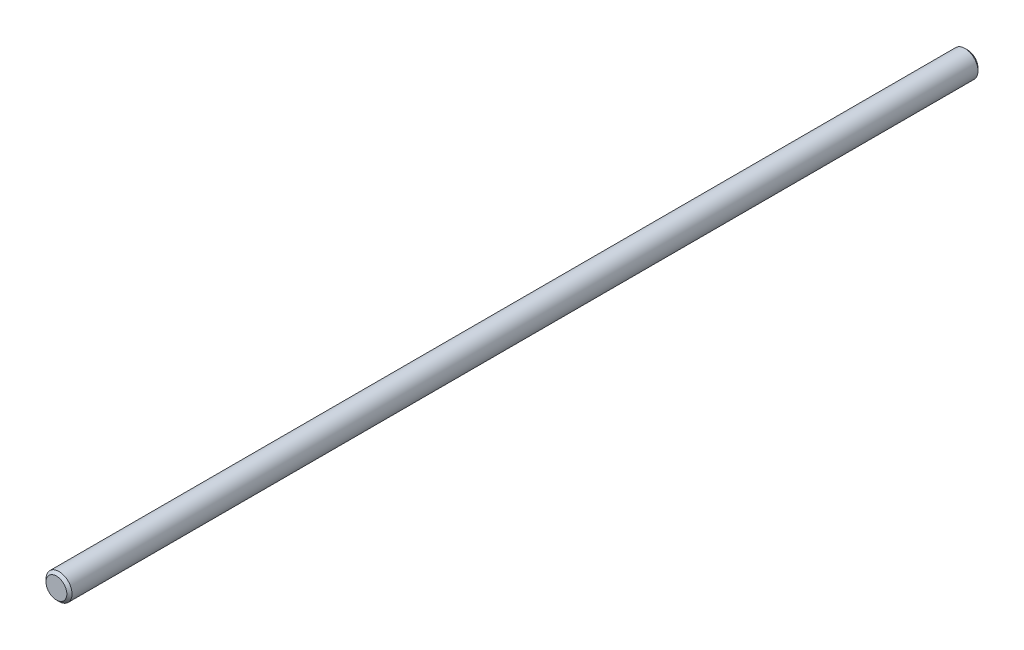
ISO-10303-21;
HEADER;
FILE_DESCRIPTION(('STEP AP214'),'2;1');
FILE_NAME('part.step','',(''),(''),'','','');
FILE_SCHEMA(('AUTOMOTIVE_DESIGN { 1 0 10303 214 1 1 1 1 }'));
ENDSEC;
DATA;
#1=APPLICATION_CONTEXT('core data for automotive mechanical design processes');
#2=APPLICATION_PROTOCOL_DEFINITION('international standard','automotive_design',2000,#1);
#3=PRODUCT_CONTEXT('',#1,'mechanical');
#4=PRODUCT('Part','Part','',(#3));
#5=PRODUCT_RELATED_PRODUCT_CATEGORY('part','',(#4));
#6=PRODUCT_DEFINITION_FORMATION('','',#4);
#7=PRODUCT_DEFINITION_CONTEXT('part definition',#1,'design');
#8=PRODUCT_DEFINITION('design','',#6,#7);
#9=PRODUCT_DEFINITION_SHAPE('','',#8);
#10=(LENGTH_UNIT() NAMED_UNIT(*) SI_UNIT(.MILLI.,.METRE.));
#11=(NAMED_UNIT(*) PLANE_ANGLE_UNIT() SI_UNIT($,.RADIAN.));
#12=(NAMED_UNIT(*) SI_UNIT($,.STERADIAN.) SOLID_ANGLE_UNIT());
#13=UNCERTAINTY_MEASURE_WITH_UNIT(LENGTH_MEASURE(1.E-05),#10,'distance_accuracy_value','');
#14=(GEOMETRIC_REPRESENTATION_CONTEXT(3) GLOBAL_UNCERTAINTY_ASSIGNED_CONTEXT((#13)) GLOBAL_UNIT_ASSIGNED_CONTEXT((#10,
#11,#12)) REPRESENTATION_CONTEXT('',''));
#15=CARTESIAN_POINT('',(0.,0.,0.));
#16=DIRECTION('',(0.,0.,1.));
#17=DIRECTION('',(1.,0.,0.));
#18=AXIS2_PLACEMENT_3D('',#15,#16,#17);
#19=CARTESIAN_POINT('',(0.,0.,175.));
#20=DIRECTION('',(0.,0.,-1.));
#21=DIRECTION('',(-1.,0.,0.));
#22=AXIS2_PLACEMENT_3D('',#19,#20,#21);
#23=CYLINDRICAL_SURFACE('',#22,2.5);
#24=CARTESIAN_POINT('',(0.,0.,0.500000000000028));
#25=DIRECTION('',(0.,0.,1.));
#26=DIRECTION('',(1.,0.,0.));
#27=AXIS2_PLACEMENT_3D('',#24,#25,#26);
#28=CIRCLE('',#27,2.5);
#29=CARTESIAN_POINT('',(2.5,0.,0.500000000000028));
#30=VERTEX_POINT('',#29);
#31=EDGE_CURVE('E40',#30,#30,#28,.T.);
#32=ORIENTED_EDGE('',*,*,#31,.T.);
#33=EDGE_LOOP('',(#32));
#34=FACE_BOUND('',#33,.T.);
#35=CARTESIAN_POINT('',(0.,0.,174.5));
#36=DIRECTION('',(0.,0.,1.));
#37=DIRECTION('',(1.,0.,0.));
#38=AXIS2_PLACEMENT_3D('',#35,#36,#37);
#39=CIRCLE('',#38,2.5);
#40=CARTESIAN_POINT('',(2.5,0.,174.5));
#41=VERTEX_POINT('',#40);
#42=EDGE_CURVE('E44',#41,#41,#39,.F.);
#43=ORIENTED_EDGE('',*,*,#42,.T.);
#44=EDGE_LOOP('',(#43));
#45=FACE_BOUND('',#44,.T.);
#46=ADVANCED_FACE('F29',(#34,#45),#23,.T.);
#47=CARTESIAN_POINT('',(0.,0.,175.));
#48=DIRECTION('',(0.,0.,1.));
#49=DIRECTION('',(1.,0.,0.));
#50=AXIS2_PLACEMENT_3D('',#47,#48,#49);
#51=PLANE('',#50);
#52=CARTESIAN_POINT('',(0.,0.,175.));
#53=DIRECTION('',(0.,0.,1.));
#54=DIRECTION('',(1.,0.,0.));
#55=AXIS2_PLACEMENT_3D('',#52,#53,#54);
#56=CIRCLE('',#55,1.99999999999999);
#57=CARTESIAN_POINT('',(1.99999999999999,0.,175.));
#58=VERTEX_POINT('',#57);
#59=EDGE_CURVE('E10',#58,#58,#56,.T.);
#60=ORIENTED_EDGE('',*,*,#59,.T.);
#61=EDGE_LOOP('',(#60));
#62=FACE_BOUND('',#61,.T.);
#63=ADVANCED_FACE('F60',(#62),#51,.T.);
#64=CARTESIAN_POINT('',(0.,0.,0.));
#65=DIRECTION('',(0.,0.,1.));
#66=DIRECTION('',(1.,0.,0.));
#67=AXIS2_PLACEMENT_3D('',#64,#65,#66);
#68=PLANE('',#67);
#69=CARTESIAN_POINT('',(0.,0.,0.));
#70=DIRECTION('',(0.,0.,1.));
#71=DIRECTION('',(1.,0.,0.));
#72=AXIS2_PLACEMENT_3D('',#69,#70,#71);
#73=CIRCLE('',#72,1.99999999999999);
#74=CARTESIAN_POINT('',(1.99999999999999,0.,0.));
#75=VERTEX_POINT('',#74);
#76=EDGE_CURVE('E36',#75,#75,#73,.F.);
#77=ORIENTED_EDGE('',*,*,#76,.T.);
#78=EDGE_LOOP('',(#77));
#79=FACE_BOUND('',#78,.T.);
#80=ADVANCED_FACE('F57',(#79),#68,.F.);
#81=CARTESIAN_POINT('',(0.,0.,0.500000000000028));
#82=DIRECTION('',(0.,0.,1.));
#83=DIRECTION('',(1.,0.,0.));
#84=AXIS2_PLACEMENT_3D('',#81,#82,#83);
#85=CONICAL_SURFACE('',#84,2.5,0.785398163397431);
#86=ORIENTED_EDGE('',*,*,#76,.F.);
#87=EDGE_LOOP('',(#86));
#88=FACE_BOUND('',#87,.T.);
#89=ORIENTED_EDGE('',*,*,#31,.F.);
#90=EDGE_LOOP('',(#89));
#91=FACE_BOUND('',#90,.T.);
#92=ADVANCED_FACE('F53',(#88,#91),#85,.T.);
#93=CARTESIAN_POINT('',(0.,0.,175.));
#94=DIRECTION('',(0.,0.,-1.));
#95=DIRECTION('',(-1.,0.,0.));
#96=AXIS2_PLACEMENT_3D('',#93,#94,#95);
#97=CONICAL_SURFACE('',#96,1.99999999999999,0.785398163397459);
#98=ORIENTED_EDGE('',*,*,#42,.F.);
#99=EDGE_LOOP('',(#98));
#100=FACE_BOUND('',#99,.T.);
#101=ORIENTED_EDGE('',*,*,#59,.F.);
#102=EDGE_LOOP('',(#101));
#103=FACE_BOUND('',#102,.T.);
#104=ADVANCED_FACE('F31',(#100,#103),#97,.T.);
#105=CLOSED_SHELL('',(#46,#63,#80,#92,#104));
#106=MANIFOLD_SOLID_BREP('B2',#105);
#107=ADVANCED_BREP_SHAPE_REPRESENTATION('',(#18,#106),#14);
#108=SHAPE_DEFINITION_REPRESENTATION(#9,#107);
ENDSEC;
END-ISO-10303-21;
